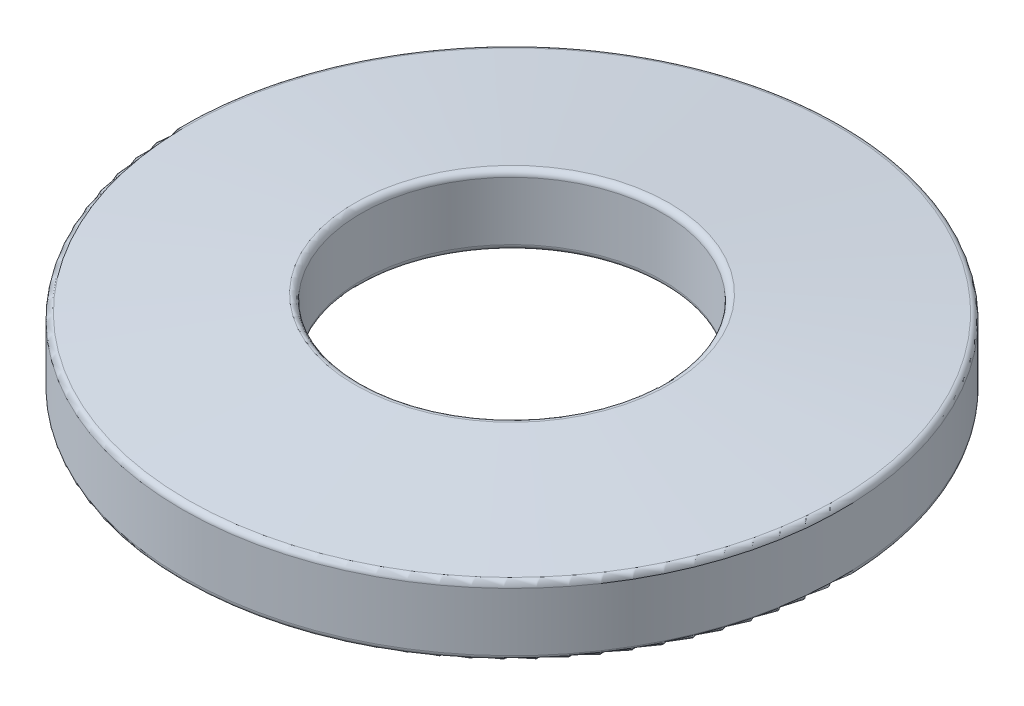
ISO-10303-21;
HEADER;
FILE_DESCRIPTION(('STEP AP214'),'2;1');
FILE_NAME('part.step','',(''),(''),'','','');
FILE_SCHEMA(('AUTOMOTIVE_DESIGN { 1 0 10303 214 1 1 1 1 }'));
ENDSEC;
DATA;
#1=APPLICATION_CONTEXT('core data for automotive mechanical design processes');
#2=APPLICATION_PROTOCOL_DEFINITION('international standard','automotive_design',2000,#1);
#3=PRODUCT_CONTEXT('',#1,'mechanical');
#4=PRODUCT('Part','Part','',(#3));
#5=PRODUCT_RELATED_PRODUCT_CATEGORY('part','',(#4));
#6=PRODUCT_DEFINITION_FORMATION('','',#4);
#7=PRODUCT_DEFINITION_CONTEXT('part definition',#1,'design');
#8=PRODUCT_DEFINITION('design','',#6,#7);
#9=PRODUCT_DEFINITION_SHAPE('','',#8);
#10=(LENGTH_UNIT() NAMED_UNIT(*) SI_UNIT(.MILLI.,.METRE.));
#11=(NAMED_UNIT(*) PLANE_ANGLE_UNIT() SI_UNIT($,.RADIAN.));
#12=(NAMED_UNIT(*) SI_UNIT($,.STERADIAN.) SOLID_ANGLE_UNIT());
#13=UNCERTAINTY_MEASURE_WITH_UNIT(LENGTH_MEASURE(1.E-05),#10,'distance_accuracy_value','');
#14=(GEOMETRIC_REPRESENTATION_CONTEXT(3) GLOBAL_UNCERTAINTY_ASSIGNED_CONTEXT((#13)) GLOBAL_UNIT_ASSIGNED_CONTEXT((#10,
#11,#12)) REPRESENTATION_CONTEXT('',''));
#15=CARTESIAN_POINT('',(0.,0.,0.));
#16=DIRECTION('',(0.,0.,1.));
#17=DIRECTION('',(1.,0.,0.));
#18=AXIS2_PLACEMENT_3D('',#15,#16,#17);
#19=CARTESIAN_POINT('',(0.,3.048,0.));
#20=DIRECTION('',(0.,-1.,0.));
#21=DIRECTION('',(0.,0.,-1.));
#22=AXIS2_PLACEMENT_3D('',#19,#20,#21);
#23=CONICAL_SURFACE('',#22,14.3637,1.47322783276692);
#24=CARTESIAN_POINT('',(0.,3.07043950116833,0.));
#25=DIRECTION('',(0.,1.,0.));
#26=DIRECTION('',(0.,0.,1.));
#27=AXIS2_PLACEMENT_3D('',#24,#25,#26);
#28=CIRCLE('',#27,14.1344430963969);
#29=CARTESIAN_POINT('',(0.,3.07043950116833,14.1344430963969));
#30=VERTEX_POINT('',#29);
#31=EDGE_CURVE('E48',#30,#30,#28,.T.);
#32=ORIENTED_EDGE('',*,*,#31,.T.);
#33=EDGE_LOOP('',(#32));
#34=FACE_BOUND('',#33,.T.);
#35=CARTESIAN_POINT('',(0.,3.78271682580128,0.));
#36=DIRECTION('',(0.,1.,0.));
#37=DIRECTION('',(0.,0.,1.));
#38=AXIS2_PLACEMENT_3D('',#35,#36,#37);
#39=CIRCLE('',#38,6.85734309639693);
#40=CARTESIAN_POINT('',(0.,3.78271682580128,6.85734309639693));
#41=VERTEX_POINT('',#40);
#42=EDGE_CURVE('E52',#41,#41,#39,.F.);
#43=ORIENTED_EDGE('',*,*,#42,.T.);
#44=EDGE_LOOP('',(#43));
#45=FACE_BOUND('',#44,.T.);
#46=ADVANCED_FACE('F37',(#34,#45),#23,.T.);
#47=CARTESIAN_POINT('',(0.,0.,0.));
#48=DIRECTION('',(0.,-1.,0.));
#49=DIRECTION('',(0.,0.,-1.));
#50=AXIS2_PLACEMENT_3D('',#47,#48,#49);
#51=CYLINDRICAL_SURFACE('',#50,6.5786);
#52=CARTESIAN_POINT('',(0.,0.992352467020325,0.));
#53=DIRECTION('',(0.,1.,0.));
#54=DIRECTION('',(0.,0.,1.));
#55=AXIS2_PLACEMENT_3D('',#52,#53,#54);
#56=CIRCLE('',#55,6.5786);
#57=CARTESIAN_POINT('',(0.,0.992352467020325,6.5786));
#58=VERTEX_POINT('',#57);
#59=EDGE_CURVE('E10',#58,#58,#56,.F.);
#60=ORIENTED_EDGE('',*,*,#59,.T.);
#61=EDGE_LOOP('',(#60));
#62=FACE_BOUND('',#61,.T.);
#63=CARTESIAN_POINT('',(0.,3.52992485761263,0.));
#64=DIRECTION('',(0.,1.,0.));
#65=DIRECTION('',(0.,0.,1.));
#66=AXIS2_PLACEMENT_3D('',#63,#64,#65);
#67=CIRCLE('',#66,6.5786);
#68=CARTESIAN_POINT('',(0.,3.52992485761263,6.5786));
#69=VERTEX_POINT('',#68);
#70=EDGE_CURVE('E44',#69,#69,#67,.T.);
#71=ORIENTED_EDGE('',*,*,#70,.T.);
#72=EDGE_LOOP('',(#71));
#73=FACE_BOUND('',#72,.T.);
#74=ADVANCED_FACE('F85',(#62,#73),#51,.F.);
#75=CARTESIAN_POINT('',(0.,0.762,0.));
#76=DIRECTION('',(0.,-1.,0.));
#77=DIRECTION('',(0.,0.,-1.));
#78=AXIS2_PLACEMENT_3D('',#75,#76,#77);
#79=CONICAL_SURFACE('',#78,6.5786,1.47322783276692);
#80=CARTESIAN_POINT('',(0.,0.0272831741987207,0.));
#81=DIRECTION('',(0.,1.,0.));
#82=DIRECTION('',(0.,0.,1.));
#83=AXIS2_PLACEMENT_3D('',#80,#81,#82);
#84=CIRCLE('',#83,14.0849569036031);
#85=CARTESIAN_POINT('',(0.,0.0272831741987207,14.0849569036031));
#86=VERTEX_POINT('',#85);
#87=EDGE_CURVE('E63',#86,#86,#84,.F.);
#88=ORIENTED_EDGE('',*,*,#87,.T.);
#89=EDGE_LOOP('',(#88));
#90=FACE_BOUND('',#89,.T.);
#91=CARTESIAN_POINT('',(0.,0.739560498831673,0.));
#92=DIRECTION('',(0.,1.,0.));
#93=DIRECTION('',(0.,0.,1.));
#94=AXIS2_PLACEMENT_3D('',#91,#92,#93);
#95=CIRCLE('',#94,6.80785690360307);
#96=CARTESIAN_POINT('',(0.,0.739560498831673,6.80785690360307));
#97=VERTEX_POINT('',#96);
#98=EDGE_CURVE('E66',#97,#97,#95,.T.);
#99=ORIENTED_EDGE('',*,*,#98,.T.);
#100=EDGE_LOOP('',(#99));
#101=FACE_BOUND('',#100,.T.);
#102=ADVANCED_FACE('F70',(#90,#101),#79,.F.);
#103=CARTESIAN_POINT('',(0.,0.,0.));
#104=DIRECTION('',(0.,-1.,0.));
#105=DIRECTION('',(0.,0.,-1.));
#106=AXIS2_PLACEMENT_3D('',#103,#104,#105);
#107=CYLINDRICAL_SURFACE('',#106,14.3637);
#108=CARTESIAN_POINT('',(0.,0.280075142387372,0.));
#109=DIRECTION('',(0.,1.,0.));
#110=DIRECTION('',(0.,0.,1.));
#111=AXIS2_PLACEMENT_3D('',#108,#109,#110);
#112=CIRCLE('',#111,14.3637);
#113=CARTESIAN_POINT('',(0.,0.280075142387372,14.3637));
#114=VERTEX_POINT('',#113);
#115=EDGE_CURVE('E57',#114,#114,#112,.T.);
#116=ORIENTED_EDGE('',*,*,#115,.T.);
#117=EDGE_LOOP('',(#116));
#118=FACE_BOUND('',#117,.T.);
#119=CARTESIAN_POINT('',(0.,2.81764753297968,0.));
#120=DIRECTION('',(0.,1.,0.));
#121=DIRECTION('',(0.,0.,1.));
#122=AXIS2_PLACEMENT_3D('',#119,#120,#121);
#123=CIRCLE('',#122,14.3637);
#124=CARTESIAN_POINT('',(0.,2.81764753297968,14.3637));
#125=VERTEX_POINT('',#124);
#126=EDGE_CURVE('E60',#125,#125,#123,.F.);
#127=ORIENTED_EDGE('',*,*,#126,.T.);
#128=EDGE_LOOP('',(#127));
#129=FACE_BOUND('',#128,.T.);
#130=ADVANCED_FACE('F96',(#118,#129),#107,.T.);
#131=CARTESIAN_POINT('',(0.,0.280075142387372,0.));
#132=DIRECTION('',(0.,1.,0.));
#133=DIRECTION('',(0.,0.,1.));
#134=AXIS2_PLACEMENT_3D('',#131,#132,#133);
#135=TOROIDAL_SURFACE('',#134,14.1097,0.254);
#136=ORIENTED_EDGE('',*,*,#115,.F.);
#137=EDGE_LOOP('',(#136));
#138=FACE_BOUND('',#137,.T.);
#139=ORIENTED_EDGE('',*,*,#87,.F.);
#140=EDGE_LOOP('',(#139));
#141=FACE_BOUND('',#140,.T.);
#142=ADVANCED_FACE('F81',(#138,#141),#135,.T.);
#143=CARTESIAN_POINT('',(0.,2.81764753297968,0.));
#144=DIRECTION('',(0.,1.,0.));
#145=DIRECTION('',(0.,0.,1.));
#146=AXIS2_PLACEMENT_3D('',#143,#144,#145);
#147=TOROIDAL_SURFACE('',#146,14.1097,0.254);
#148=ORIENTED_EDGE('',*,*,#31,.F.);
#149=EDGE_LOOP('',(#148));
#150=FACE_BOUND('',#149,.T.);
#151=ORIENTED_EDGE('',*,*,#126,.F.);
#152=EDGE_LOOP('',(#151));
#153=FACE_BOUND('',#152,.T.);
#154=ADVANCED_FACE('F75',(#150,#153),#147,.T.);
#155=CARTESIAN_POINT('',(0.,0.992352467020325,0.));
#156=DIRECTION('',(0.,1.,0.));
#157=DIRECTION('',(0.,0.,1.));
#158=AXIS2_PLACEMENT_3D('',#155,#156,#157);
#159=TOROIDAL_SURFACE('',#158,6.8326,0.254);
#160=ORIENTED_EDGE('',*,*,#98,.F.);
#161=EDGE_LOOP('',(#160));
#162=FACE_BOUND('',#161,.T.);
#163=ORIENTED_EDGE('',*,*,#59,.F.);
#164=EDGE_LOOP('',(#163));
#165=FACE_BOUND('',#164,.T.);
#166=ADVANCED_FACE('F72',(#162,#165),#159,.T.);
#167=CARTESIAN_POINT('',(0.,3.52992485761263,0.));
#168=DIRECTION('',(0.,1.,0.));
#169=DIRECTION('',(0.,0.,1.));
#170=AXIS2_PLACEMENT_3D('',#167,#168,#169);
#171=TOROIDAL_SURFACE('',#170,6.8326,0.254);
#172=ORIENTED_EDGE('',*,*,#70,.F.);
#173=EDGE_LOOP('',(#172));
#174=FACE_BOUND('',#173,.T.);
#175=ORIENTED_EDGE('',*,*,#42,.F.);
#176=EDGE_LOOP('',(#175));
#177=FACE_BOUND('',#176,.T.);
#178=ADVANCED_FACE('F39',(#174,#177),#171,.T.);
#179=CLOSED_SHELL('',(#46,#74,#102,#130,#142,#154,#166,#178));
#180=MANIFOLD_SOLID_BREP('B2',#179);
#181=ADVANCED_BREP_SHAPE_REPRESENTATION('',(#18,#180),#14);
#182=SHAPE_DEFINITION_REPRESENTATION(#9,#181);
ENDSEC;
END-ISO-10303-21;
